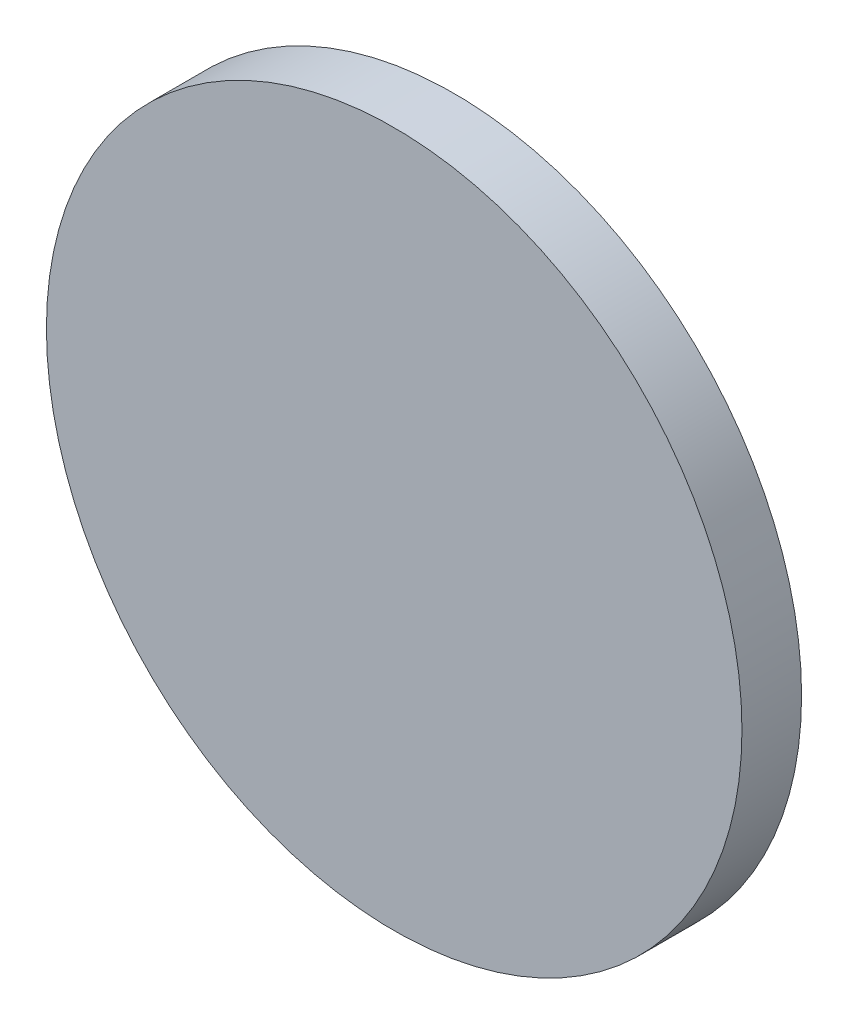
ISO-10303-21;
HEADER;
FILE_DESCRIPTION(('STEP AP214'),'2;1');
FILE_NAME('part.step','',(''),(''),'','','');
FILE_SCHEMA(('AUTOMOTIVE_DESIGN { 1 0 10303 214 1 1 1 1 }'));
ENDSEC;
DATA;
#1=APPLICATION_CONTEXT('core data for automotive mechanical design processes');
#2=APPLICATION_PROTOCOL_DEFINITION('international standard','automotive_design',2000,#1);
#3=PRODUCT_CONTEXT('',#1,'mechanical');
#4=PRODUCT('Part','Part','',(#3));
#5=PRODUCT_RELATED_PRODUCT_CATEGORY('part','',(#4));
#6=PRODUCT_DEFINITION_FORMATION('','',#4);
#7=PRODUCT_DEFINITION_CONTEXT('part definition',#1,'design');
#8=PRODUCT_DEFINITION('design','',#6,#7);
#9=PRODUCT_DEFINITION_SHAPE('','',#8);
#10=(LENGTH_UNIT() NAMED_UNIT(*) SI_UNIT(.MILLI.,.METRE.));
#11=(NAMED_UNIT(*) PLANE_ANGLE_UNIT() SI_UNIT($,.RADIAN.));
#12=(NAMED_UNIT(*) SI_UNIT($,.STERADIAN.) SOLID_ANGLE_UNIT());
#13=UNCERTAINTY_MEASURE_WITH_UNIT(LENGTH_MEASURE(1.E-05),#10,'distance_accuracy_value','');
#14=(GEOMETRIC_REPRESENTATION_CONTEXT(3) GLOBAL_UNCERTAINTY_ASSIGNED_CONTEXT((#13)) GLOBAL_UNIT_ASSIGNED_CONTEXT((#10,
#11,#12)) REPRESENTATION_CONTEXT('',''));
#15=CARTESIAN_POINT('',(0.,0.,0.));
#16=DIRECTION('',(0.,0.,1.));
#17=DIRECTION('',(1.,0.,0.));
#18=AXIS2_PLACEMENT_3D('',#15,#16,#17);
#19=CARTESIAN_POINT('',(2.20008,10.150000006176,0.76487));
#20=DIRECTION('',(0.,0.,-1.));
#21=DIRECTION('',(-1.,0.,0.));
#22=AXIS2_PLACEMENT_3D('',#19,#20,#21);
#23=PLANE('',#22);
#24=CARTESIAN_POINT('',(2.20008,10.150000006176,0.76487));
#25=DIRECTION('',(0.,0.,1.));
#26=DIRECTION('',(1.,0.,0.));
#27=AXIS2_PLACEMENT_3D('',#24,#25,#26);
#28=CIRCLE('',#27,0.200024667);
#29=CARTESIAN_POINT('',(2.400104667,10.150000006176,0.76487));
#30=VERTEX_POINT('',#29);
#31=EDGE_CURVE('E18',#30,#30,#28,.T.);
#32=ORIENTED_EDGE('',*,*,#31,.F.);
#33=EDGE_LOOP('',(#32));
#34=FACE_BOUND('',#33,.T.);
#35=ADVANCED_FACE('F15',(#34),#23,.T.);
#36=CARTESIAN_POINT('',(2.20008,10.150000006176,0.76487));
#37=DIRECTION('',(0.,0.,1.));
#38=DIRECTION('',(1.,0.,0.));
#39=AXIS2_PLACEMENT_3D('',#36,#37,#38);
#40=CYLINDRICAL_SURFACE('',#39,0.200024667);
#41=CARTESIAN_POINT('',(2.20008,10.150000006176,0.79916));
#42=DIRECTION('',(0.,0.,1.));
#43=DIRECTION('',(1.,0.,0.));
#44=AXIS2_PLACEMENT_3D('',#41,#42,#43);
#45=CIRCLE('',#44,0.200024667);
#46=CARTESIAN_POINT('',(2.400104667,10.150000006176,0.79916));
#47=VERTEX_POINT('',#46);
#48=EDGE_CURVE('E10',#47,#47,#45,.T.);
#49=ORIENTED_EDGE('',*,*,#48,.F.);
#50=EDGE_LOOP('',(#49));
#51=FACE_BOUND('',#50,.T.);
#52=ORIENTED_EDGE('',*,*,#31,.T.);
#53=EDGE_LOOP('',(#52));
#54=FACE_BOUND('',#53,.T.);
#55=ADVANCED_FACE('F27',(#51,#54),#40,.T.);
#56=CARTESIAN_POINT('',(2.20008,10.150000006176,0.79916));
#57=DIRECTION('',(0.,0.,1.));
#58=DIRECTION('',(1.,0.,0.));
#59=AXIS2_PLACEMENT_3D('',#56,#57,#58);
#60=PLANE('',#59);
#61=ORIENTED_EDGE('',*,*,#48,.T.);
#62=EDGE_LOOP('',(#61));
#63=FACE_BOUND('',#62,.T.);
#64=ADVANCED_FACE('F34',(#63),#60,.T.);
#65=CLOSED_SHELL('',(#35,#55,#64));
#66=MANIFOLD_SOLID_BREP('B1',#65);
#67=ADVANCED_BREP_SHAPE_REPRESENTATION('',(#18,#66),#14);
#68=SHAPE_DEFINITION_REPRESENTATION(#9,#67);
ENDSEC;
END-ISO-10303-21;
